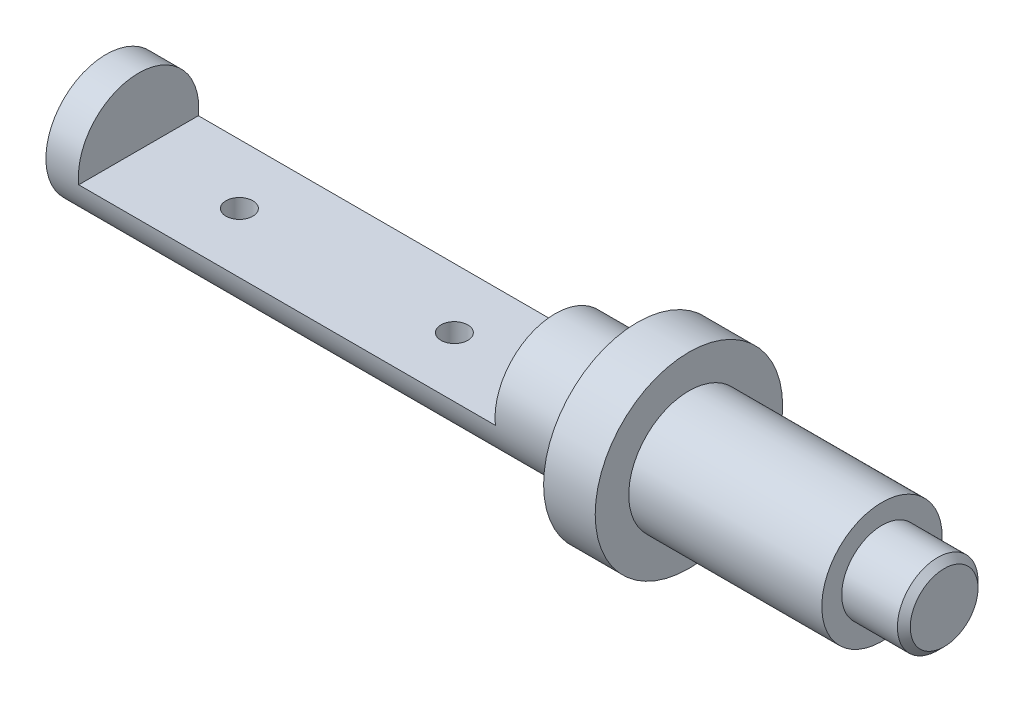
ISO-10303-21;
HEADER;
FILE_DESCRIPTION(('STEP AP214'),'2;1');
FILE_NAME('part.step','',(''),(''),'','','');
FILE_SCHEMA(('AUTOMOTIVE_DESIGN { 1 0 10303 214 1 1 1 1 }'));
ENDSEC;
DATA;
#1=APPLICATION_CONTEXT('core data for automotive mechanical design processes');
#2=APPLICATION_PROTOCOL_DEFINITION('international standard','automotive_design',2000,#1);
#3=PRODUCT_CONTEXT('',#1,'mechanical');
#4=PRODUCT('Part','Part','',(#3));
#5=PRODUCT_RELATED_PRODUCT_CATEGORY('part','',(#4));
#6=PRODUCT_DEFINITION_FORMATION('','',#4);
#7=PRODUCT_DEFINITION_CONTEXT('part definition',#1,'design');
#8=PRODUCT_DEFINITION('design','',#6,#7);
#9=PRODUCT_DEFINITION_SHAPE('','',#8);
#10=(LENGTH_UNIT() NAMED_UNIT(*) SI_UNIT(.MILLI.,.METRE.));
#11=(NAMED_UNIT(*) PLANE_ANGLE_UNIT() SI_UNIT($,.RADIAN.));
#12=(NAMED_UNIT(*) SI_UNIT($,.STERADIAN.) SOLID_ANGLE_UNIT());
#13=UNCERTAINTY_MEASURE_WITH_UNIT(LENGTH_MEASURE(1.E-05),#10,'distance_accuracy_value','');
#14=(GEOMETRIC_REPRESENTATION_CONTEXT(3) GLOBAL_UNCERTAINTY_ASSIGNED_CONTEXT((#13)) GLOBAL_UNIT_ASSIGNED_CONTEXT((#10,
#11,#12)) REPRESENTATION_CONTEXT('',''));
#15=CARTESIAN_POINT('',(0.,0.,0.));
#16=DIRECTION('',(0.,0.,1.));
#17=DIRECTION('',(1.,0.,0.));
#18=AXIS2_PLACEMENT_3D('',#15,#16,#17);
#19=CARTESIAN_POINT('',(247.1,0.,0.));
#20=DIRECTION('',(-1.,0.,0.));
#21=DIRECTION('',(0.,0.,1.));
#22=AXIS2_PLACEMENT_3D('',#19,#20,#21);
#23=CYLINDRICAL_SURFACE('',#22,28.);
#24=CARTESIAN_POINT('',(62.,-27.2935431924842,6.25));
#25=CARTESIAN_POINT('',(61.8267727598686,-27.2935406630598,6.25000418094473));
#26=CARTESIAN_POINT('',(61.6535945838765,-27.2951952944761,6.24279659776609));
#27=CARTESIAN_POINT('',(61.3084452049208,-27.3017584796593,6.21403440350836));
#28=CARTESIAN_POINT('',(61.1364741812,-27.3066675067386,6.19247770552275));
#29=CARTESIAN_POINT('',(60.7949630146807,-27.3195986301189,6.1351760833499));
#30=CARTESIAN_POINT('',(60.6254239581023,-27.3276220751525,6.09942501198105));
#31=CARTESIAN_POINT('',(60.2899852832194,-27.3465464155529,6.0140096724512));
#32=CARTESIAN_POINT('',(60.1240870317926,-27.3574483722473,5.96434027208897));
#33=CARTESIAN_POINT('',(59.7973982391902,-27.3817905916842,5.8515692430011));
#34=CARTESIAN_POINT('',(59.6366003461767,-27.3952269869804,5.78848806167798));
#35=CARTESIAN_POINT('',(59.3208790393078,-27.4242678496656,5.64929956777815));
#36=CARTESIAN_POINT('',(59.1659578199311,-27.4398731170088,5.57318744653334));
#37=CARTESIAN_POINT('',(58.8631396758863,-27.4728000717142,5.40853934345901));
#38=CARTESIAN_POINT('',(58.7152399398922,-27.4901210633973,5.32000839111389));
#39=CARTESIAN_POINT('',(58.4273048075419,-27.5260101395214,5.13108281812592));
#40=CARTESIAN_POINT('',(58.2872723861792,-27.5445786899706,5.03068375356068));
#41=CARTESIAN_POINT('',(58.013935535353,-27.5827411710545,4.81708795276356));
#42=CARTESIAN_POINT('',(57.8807683889474,-27.6023465077547,4.70371753740178));
#43=CARTESIAN_POINT('',(57.6243676029388,-27.6417727676251,4.46619442991224));
#44=CARTESIAN_POINT('',(57.5011376659008,-27.6615937680575,4.34203775433223));
#45=CARTESIAN_POINT('',(57.2655232423443,-27.7008894748951,4.08384197537745));
#46=CARTESIAN_POINT('',(57.1531356719486,-27.7203642784753,3.9498057012888));
#47=CARTESIAN_POINT('',(56.9398937419835,-27.7584430824459,3.67265674935636));
#48=CARTESIAN_POINT('',(56.8390436467614,-27.7770467593696,3.5295407457563));
#49=CARTESIAN_POINT('',(56.6486245646214,-27.813052346094,3.23365995739578));
#50=CARTESIAN_POINT('',(56.559186955487,-27.8304393713552,3.08080874634002));
#51=CARTESIAN_POINT('',(56.3934979284126,-27.8633050823482,2.76785167600483));
#52=CARTESIAN_POINT('',(56.3172514737377,-27.8787830491573,2.60774311456664));
#53=CARTESIAN_POINT('',(56.1786061723866,-27.9073737582624,2.28150107379451));
#54=CARTESIAN_POINT('',(56.1162009342469,-27.9204875917193,2.11537041669151));
#55=CARTESIAN_POINT('',(56.0056756050297,-27.9439896454641,1.7782375642397));
#56=CARTESIAN_POINT('',(55.957560676261,-27.9543768806238,1.60723363283174));
#57=CARTESIAN_POINT('',(55.8366940053748,-27.9806601200355,1.09439758323674));
#58=CARTESIAN_POINT('',(55.7849884834218,-27.9921960538677,0.746994222027666));
#59=CARTESIAN_POINT('',(55.7515346610221,-27.9996585490209,0.223520525139074));
#60=CARTESIAN_POINT('',(55.7477414297263,-28.0005041840467,0.0485642360945816));
#61=CARTESIAN_POINT('',(55.7548089715722,-27.9989265851302,-0.301058844425902));
#62=CARTESIAN_POINT('',(55.7656699488484,-27.9965033056516,-0.475725631835172));
#63=CARTESIAN_POINT('',(55.819554977227,-27.9845298925051,-0.991080970449512));
#64=CARTESIAN_POINT('',(55.8834769760275,-27.9703645197021,-1.32971272514979));
#65=CARTESIAN_POINT('',(56.0657163769346,-27.9310839487509,-1.99113945055511));
#66=CARTESIAN_POINT('',(56.1840363043649,-27.9059682422566,-2.31393368526248));
#67=CARTESIAN_POINT('',(56.4726136935572,-27.8472521946706,-2.9375819596219));
#68=CARTESIAN_POINT('',(56.6432572483036,-27.8135891116371,-3.23825157149134));
#69=CARTESIAN_POINT('',(57.0313486445811,-27.7414625355304,-3.80704732566786));
#70=CARTESIAN_POINT('',(57.2488031079672,-27.7029983636206,-4.07516885533364));
#71=CARTESIAN_POINT('',(57.729924683463,-27.6245113562129,-4.57738580559884));
#72=CARTESIAN_POINT('',(57.9944906861916,-27.5844728055815,-4.81061849864798));
#73=CARTESIAN_POINT('',(58.5593957192654,-27.5081274935844,-5.22957036099764));
#74=CARTESIAN_POINT('',(58.8597358020281,-27.4718208420638,-5.41528813197723));
#75=CARTESIAN_POINT('',(59.4890983296703,-27.4070063654906,-5.73434528879876));
#76=CARTESIAN_POINT('',(59.818209250125,-27.3785237986948,-5.86751562740584));
#77=CARTESIAN_POINT('',(60.4949262723236,-27.332928106913,-6.07639622505651));
#78=CARTESIAN_POINT('',(60.8425292948424,-27.3158130954113,-6.15211601866805));
#79=CARTESIAN_POINT('',(61.5384634697485,-27.2952766976967,-6.24259542089443));
#80=CARTESIAN_POINT('',(61.8866227947728,-27.291572561069,-6.25861396727172));
#81=CARTESIAN_POINT('',(62.5806372664177,-27.2975136372093,-6.23264970129104));
#82=CARTESIAN_POINT('',(62.9264925766479,-27.3071578917233,-6.19067105243459));
#83=CARTESIAN_POINT('',(63.6016587871162,-27.3384415167487,-6.0509982957265));
#84=CARTESIAN_POINT('',(63.9311218532032,-27.3599303668854,-5.95400289682963));
#85=CARTESIAN_POINT('',(64.569119561196,-27.4123452195024,-5.70780773520873));
#86=CARTESIAN_POINT('',(64.8776521284731,-27.443272155819,-5.55860280648198));
#87=CARTESIAN_POINT('',(65.4704621534331,-27.5116960387507,-5.20947386615223));
#88=CARTESIAN_POINT('',(65.7542732390405,-27.5492900747217,-5.00877748022629));
#89=CARTESIAN_POINT('',(66.2846538000829,-27.6265592430673,-4.56335143969624));
#90=CARTESIAN_POINT('',(66.5312184416144,-27.6662346446662,-4.3186160786589));
#91=CARTESIAN_POINT('',(66.98500466893,-27.7441297258463,-3.78641602648042));
#92=CARTESIAN_POINT('',(67.1913659211403,-27.7823059698253,-3.49821158905154));
#93=CARTESIAN_POINT('',(67.5527917615435,-27.8520981732882,-2.89029963896411));
#94=CARTESIAN_POINT('',(67.7078587965041,-27.8837144456601,-2.57059362989544));
#95=CARTESIAN_POINT('',(67.8978877198154,-27.9234467514472,-2.07570333708499));
#96=CARTESIAN_POINT('',(67.9540381691156,-27.9353862929346,-1.90866854996694));
#97=CARTESIAN_POINT('',(68.0520741970871,-27.9564443638961,-1.57030628341015));
#98=CARTESIAN_POINT('',(68.0939650692829,-27.9655639400989,-1.39898042234159));
#99=CARTESIAN_POINT('',(68.1631339402457,-27.9807181181667,-1.05326831573389));
#100=CARTESIAN_POINT('',(68.190410923789,-27.986752505703,-0.878881858444701));
#101=CARTESIAN_POINT('',(68.2301247347132,-27.9955635060914,-0.528347318502349));
#102=CARTESIAN_POINT('',(68.2425621553816,-27.9983402491844,-0.352199306560297));
#103=CARTESIAN_POINT('',(68.2523827048559,-28.0005315872801,-0.00328258899923557));
#104=CARTESIAN_POINT('',(68.250085760547,-28.0000176335599,0.169476763448765));
#105=CARTESIAN_POINT('',(68.2312052525231,-27.9958092230281,0.514171279855283));
#106=CARTESIAN_POINT('',(68.2146219799416,-27.992114831029,0.686106460537359));
#107=CARTESIAN_POINT('',(68.1673008891383,-27.9816470037885,1.02794898351237));
#108=CARTESIAN_POINT('',(68.1365608405084,-27.9748730833678,1.19785600193811));
#109=CARTESIAN_POINT('',(68.0611864987827,-27.9584357777394,1.53435186906267));
#110=CARTESIAN_POINT('',(68.0165571474954,-27.9487734202847,1.70094187555779));
#111=CARTESIAN_POINT('',(67.9139133361203,-27.9268574568712,2.02918872938452));
#112=CARTESIAN_POINT('',(67.8559415493875,-27.9146121223051,2.19085948233516));
#113=CARTESIAN_POINT('',(67.7269966145685,-27.8878471112107,2.50866639727836));
#114=CARTESIAN_POINT('',(67.6560280366416,-27.8733282344044,2.66480448180284));
#115=CARTESIAN_POINT('',(67.501559769507,-27.8423945526458,2.97063998638388));
#116=CARTESIAN_POINT('',(67.4180547531253,-27.825978942391,3.12033463343339));
#117=CARTESIAN_POINT('',(67.2391533318032,-27.7916988602938,3.41219288944291));
#118=CARTESIAN_POINT('',(67.1437609417994,-27.7738348783443,3.55435901815255));
#119=CARTESIAN_POINT('',(66.9396806765526,-27.7367568229686,3.83307740152881));
#120=CARTESIAN_POINT('',(66.8307645819695,-27.7175228620528,3.96945995543579));
#121=CARTESIAN_POINT('',(66.6019929027212,-27.67856827949,4.23255724998559));
#122=CARTESIAN_POINT('',(66.4821411207662,-27.6588478287394,4.35927532336927));
#123=CARTESIAN_POINT('',(66.2321906977458,-27.619444285287,4.60233284521469));
#124=CARTESIAN_POINT('',(66.1020859558028,-27.5997612220746,4.71866602514744));
#125=CARTESIAN_POINT('',(65.8326020185938,-27.5609972321728,4.94004645388396));
#126=CARTESIAN_POINT('',(65.6932262291355,-27.5419160881188,5.04509781049821));
#127=CARTESIAN_POINT('',(65.4039951713818,-27.5046146614129,5.24467646780603));
#128=CARTESIAN_POINT('',(65.2540174677039,-27.4864108262583,5.33902953184629));
#129=CARTESIAN_POINT('',(64.9465022207077,-27.4517038520395,5.51470510633685));
#130=CARTESIAN_POINT('',(64.7889674894038,-27.4352000874545,5.59603241561453));
#131=CARTESIAN_POINT('',(64.4674592811525,-27.4043843599854,5.74504238460735));
#132=CARTESIAN_POINT('',(64.3034893195969,-27.3900712207976,5.81273237339837));
#133=CARTESIAN_POINT('',(63.97025885759,-27.3640603447371,5.93397254806088));
#134=CARTESIAN_POINT('',(63.8009992932005,-27.3523621480712,5.98752522003901));
#135=CARTESIAN_POINT('',(63.3647112632614,-27.3263643748797,6.10534932009698));
#136=CARTESIAN_POINT('',(63.0947562756293,-27.3141314337926,6.15951030297508));
#137=CARTESIAN_POINT('',(62.5498261754481,-27.2977230622745,6.2318313742948));
#138=CARTESIAN_POINT('',(62.2748513291159,-27.2935472058002,6.24999336629612));
#139=CARTESIAN_POINT('',(62.,-27.2935431924842,6.25));
#140=B_SPLINE_CURVE_WITH_KNOTS('',3,(#24,#25,#26,#27,#28,#29,#30,#31,#32,#33,#34,#35,#36,#37,
#38,#39,#40,#41,#42,#43,#44,#45,#46,#47,#48,#49,#50,#51,#52,#53,#54,#55,#56,#57,#58,#59,#60,#61,
#62,#63,#64,#65,#66,#67,#68,#69,#70,#71,#72,#73,#74,#75,#76,#77,#78,#79,#80,#81,#82,#83,#84,#85,
#86,#87,#88,#89,#90,#91,#92,#93,#94,#95,#96,#97,#98,#99,#100,#101,#102,#103,#104,#105,#106,#107,
#108,#109,#110,#111,#112,#113,#114,#115,#116,#117,#118,#119,#120,#121,#122,#123,#124,#125,#126,
#127,#128,#129,#130,#131,#132,#133,#134,#135,#136,#137,#138,#139),.UNSPECIFIED.,.T.,.F.,(4,2,2,
2,2,2,2,2,2,2,2,2,2,2,2,2,2,2,2,2,2,2,2,2,2,2,2,2,2,2,2,2,2,2,2,2,2,2,2,2,2,2,2,2,2,2,2,2,2,2,2,
2,2,2,2,2,2,4),(0.,0.519439608500139,1.03895477976752,1.55869518419967,2.07862748884639,
2.59777272482058,3.1171099499522,3.63623745343966,4.15555995961572,4.68290174643606,
5.21043911948484,5.73782600077029,6.26540718315176,6.79859906273959,7.33199112529032,
7.86513636801499,8.39847397341278,9.44659898859372,9.97108019976341,10.4955687170816,
11.5250017072293,12.5544824917318,13.5917504134608,14.6291651632887,15.6890487552906,
16.7489635351156,17.8122608342571,18.8753816285583,19.9159529707268,20.9564496162611,
21.9840187566687,23.0116896012437,24.0557822772237,25.10001034103,26.1645877935077,
27.229114457624,27.7584522517355,28.2875933270914,28.8167711569939,29.3459278295956,
29.8636344148691,30.3813304503266,30.8991080770091,31.4167016888243,31.9326623270648,
32.4484418813475,32.9644412321529,33.4802667751747,34.0064342303606,34.5324194115064,
35.0587199707588,35.5848282449849,36.1185476697549,36.6520700120354,37.1853048551527,
37.7184458641198,38.542659288208,39.3668291282597),.UNSPECIFIED.);
#141=CARTESIAN_POINT('',(62.,-27.2935431924842,6.25));
#142=VERTEX_POINT('',#141);
#143=EDGE_CURVE('E76',#142,#142,#140,.T.);
#144=ORIENTED_EDGE('',*,*,#143,.F.);
#145=EDGE_LOOP('',(#144));
#146=FACE_BOUND('',#145,.T.);
#147=CARTESIAN_POINT('',(162.,-27.2935431924842,6.25));
#148=CARTESIAN_POINT('',(161.826772759869,-27.2935406630598,6.25000418094473));
#149=CARTESIAN_POINT('',(161.653594583877,-27.2951952944761,6.24279659776609));
#150=CARTESIAN_POINT('',(161.308445204921,-27.3017584796593,6.21403440350836));
#151=CARTESIAN_POINT('',(161.1364741812,-27.3066675067386,6.19247770552275));
#152=CARTESIAN_POINT('',(160.794963014681,-27.3195986301189,6.1351760833499));
#153=CARTESIAN_POINT('',(160.625423958102,-27.3276220751525,6.09942501198105));
#154=CARTESIAN_POINT('',(160.289985283219,-27.3465464155529,6.0140096724512));
#155=CARTESIAN_POINT('',(160.124087031793,-27.3574483722473,5.96434027208896));
#156=CARTESIAN_POINT('',(159.79739823919,-27.3817905916842,5.85156924300109));
#157=CARTESIAN_POINT('',(159.636600346177,-27.3952269869804,5.78848806167797));
#158=CARTESIAN_POINT('',(159.320879039308,-27.4242678496656,5.64929956777814));
#159=CARTESIAN_POINT('',(159.165957819931,-27.4398731170088,5.57318744653333));
#160=CARTESIAN_POINT('',(158.863139675886,-27.4728000717142,5.40853934345899));
#161=CARTESIAN_POINT('',(158.715239939892,-27.4901210633973,5.32000839111387));
#162=CARTESIAN_POINT('',(158.427304807542,-27.5260101395214,5.1310828181259));
#163=CARTESIAN_POINT('',(158.287272386179,-27.5445786899706,5.03068375356067));
#164=CARTESIAN_POINT('',(158.013935535353,-27.5827411710545,4.81708795276356));
#165=CARTESIAN_POINT('',(157.880768388947,-27.6023465077547,4.70371753740177));
#166=CARTESIAN_POINT('',(157.624367602939,-27.6417727676251,4.46619442991223));
#167=CARTESIAN_POINT('',(157.501137665901,-27.6615937680575,4.34203775433222));
#168=CARTESIAN_POINT('',(157.265523242344,-27.7008894748951,4.08384197537743));
#169=CARTESIAN_POINT('',(157.153135671949,-27.7203642784753,3.94980570128878));
#170=CARTESIAN_POINT('',(156.939893741983,-27.7584430824459,3.67265674935633));
#171=CARTESIAN_POINT('',(156.839043646761,-27.7770467593696,3.52954074575627));
#172=CARTESIAN_POINT('',(156.648624564621,-27.813052346094,3.23365995739575));
#173=CARTESIAN_POINT('',(156.559186955487,-27.8304393713552,3.08080874633999));
#174=CARTESIAN_POINT('',(156.393497928413,-27.8633050823483,2.7678516760048));
#175=CARTESIAN_POINT('',(156.317251473738,-27.8787830491573,2.60774311456661));
#176=CARTESIAN_POINT('',(156.178606172387,-27.9073737582624,2.28150107379449));
#177=CARTESIAN_POINT('',(156.116200934247,-27.9204875917193,2.11537041669149));
#178=CARTESIAN_POINT('',(156.00567560503,-27.9439896454641,1.77823756423969));
#179=CARTESIAN_POINT('',(155.957560676261,-27.9543768806238,1.60723363283173));
#180=CARTESIAN_POINT('',(155.836694005375,-27.9806601200355,1.09439758323673));
#181=CARTESIAN_POINT('',(155.784988483422,-27.9921960538677,0.746994222027654));
#182=CARTESIAN_POINT('',(155.751534661022,-27.9996585490209,0.22352052513906));
#183=CARTESIAN_POINT('',(155.747741429726,-28.0005041840467,0.0485642360945672));
#184=CARTESIAN_POINT('',(155.754808971572,-27.9989265851302,-0.301058844425917));
#185=CARTESIAN_POINT('',(155.765669948848,-27.9965033056516,-0.475725631835187));
#186=CARTESIAN_POINT('',(155.819554977227,-27.9845298925051,-0.99108097044953));
#187=CARTESIAN_POINT('',(155.883476976027,-27.9703645197021,-1.32971272514981));
#188=CARTESIAN_POINT('',(156.065716376935,-27.9310839487509,-1.99113945055513));
#189=CARTESIAN_POINT('',(156.184036304365,-27.9059682422566,-2.31393368526249));
#190=CARTESIAN_POINT('',(156.472613693557,-27.8472521946706,-2.93758195962191));
#191=CARTESIAN_POINT('',(156.643257248304,-27.8135891116371,-3.23825157149135));
#192=CARTESIAN_POINT('',(157.031348644581,-27.7414625355304,-3.80704732566788));
#193=CARTESIAN_POINT('',(157.248803107967,-27.7029983636206,-4.07516885533365));
#194=CARTESIAN_POINT('',(157.729924683463,-27.6245113562129,-4.57738580559885));
#195=CARTESIAN_POINT('',(157.994490686192,-27.5844728055815,-4.81061849864799));
#196=CARTESIAN_POINT('',(158.559395719265,-27.5081274935844,-5.22957036099765));
#197=CARTESIAN_POINT('',(158.859735802028,-27.4718208420638,-5.41528813197724));
#198=CARTESIAN_POINT('',(159.48909832967,-27.4070063654906,-5.73434528879876));
#199=CARTESIAN_POINT('',(159.818209250125,-27.3785237986948,-5.86751562740585));
#200=CARTESIAN_POINT('',(160.494926272324,-27.332928106913,-6.07639622505651));
#201=CARTESIAN_POINT('',(160.842529294842,-27.3158130954113,-6.15211601866805));
#202=CARTESIAN_POINT('',(161.538463469748,-27.2952766976967,-6.24259542089443));
#203=CARTESIAN_POINT('',(161.886622794773,-27.291572561069,-6.25861396727172));
#204=CARTESIAN_POINT('',(162.580637266418,-27.2975136372093,-6.23264970129104));
#205=CARTESIAN_POINT('',(162.926492576648,-27.3071578917233,-6.19067105243459));
#206=CARTESIAN_POINT('',(163.601658787116,-27.3384415167487,-6.0509982957265));
#207=CARTESIAN_POINT('',(163.931121853203,-27.3599303668854,-5.95400289682962));
#208=CARTESIAN_POINT('',(164.569119561196,-27.4123452195024,-5.70780773520872));
#209=CARTESIAN_POINT('',(164.877652128473,-27.443272155819,-5.55860280648197));
#210=CARTESIAN_POINT('',(165.470462153433,-27.5116960387507,-5.20947386615222));
#211=CARTESIAN_POINT('',(165.754273239041,-27.5492900747217,-5.00877748022627));
#212=CARTESIAN_POINT('',(166.284653800083,-27.6265592430673,-4.56335143969623));
#213=CARTESIAN_POINT('',(166.531218441614,-27.6662346446662,-4.31861607865889));
#214=CARTESIAN_POINT('',(166.98500466893,-27.7441297258463,-3.78641602648041));
#215=CARTESIAN_POINT('',(167.19136592114,-27.7823059698253,-3.49821158905152));
#216=CARTESIAN_POINT('',(167.552791761544,-27.8520981732882,-2.89029963896408));
#217=CARTESIAN_POINT('',(167.707858796504,-27.8837144456601,-2.57059362989542));
#218=CARTESIAN_POINT('',(167.897887719815,-27.9234467514472,-2.07570333708496));
#219=CARTESIAN_POINT('',(167.954038169116,-27.9353862929347,-1.9086685499669));
#220=CARTESIAN_POINT('',(168.052074197087,-27.9564443638961,-1.57030628341012));
#221=CARTESIAN_POINT('',(168.093965069283,-27.9655639400989,-1.39898042234157));
#222=CARTESIAN_POINT('',(168.163133940246,-27.9807181181667,-1.05326831573387));
#223=CARTESIAN_POINT('',(168.190410923789,-27.986752505703,-0.878881858444676));
#224=CARTESIAN_POINT('',(168.230124734713,-27.9955635060914,-0.528347318502326));
#225=CARTESIAN_POINT('',(168.242562155382,-27.9983402491844,-0.352199306560276));
#226=CARTESIAN_POINT('',(168.252382704856,-28.0005315872801,-0.00328258899921573));
#227=CARTESIAN_POINT('',(168.250085760547,-28.0000176335599,0.169476763448785));
#228=CARTESIAN_POINT('',(168.231205252523,-27.9958092230281,0.514171279855303));
#229=CARTESIAN_POINT('',(168.214621979942,-27.992114831029,0.68610646053738));
#230=CARTESIAN_POINT('',(168.167300889138,-27.9816470037885,1.02794898351239));
#231=CARTESIAN_POINT('',(168.136560840508,-27.9748730833678,1.19785600193814));
#232=CARTESIAN_POINT('',(168.061186498783,-27.9584357777394,1.53435186906269));
#233=CARTESIAN_POINT('',(168.016557147495,-27.9487734202847,1.70094187555781));
#234=CARTESIAN_POINT('',(167.91391333612,-27.9268574568712,2.02918872938454));
#235=CARTESIAN_POINT('',(167.855941549387,-27.9146121223051,2.19085948233518));
#236=CARTESIAN_POINT('',(167.726996614568,-27.8878471112107,2.50866639727837));
#237=CARTESIAN_POINT('',(167.656028036642,-27.8733282344044,2.66480448180285));
#238=CARTESIAN_POINT('',(167.501559769507,-27.8423945526458,2.97063998638388));
#239=CARTESIAN_POINT('',(167.418054753125,-27.825978942391,3.12033463343339));
#240=CARTESIAN_POINT('',(167.239153331803,-27.7916988602938,3.41219288944291));
#241=CARTESIAN_POINT('',(167.143760941799,-27.7738348783443,3.55435901815255));
#242=CARTESIAN_POINT('',(166.939680676553,-27.7367568229686,3.83307740152883));
#243=CARTESIAN_POINT('',(166.83076458197,-27.7175228620528,3.9694599554358));
#244=CARTESIAN_POINT('',(166.601992902721,-27.67856827949,4.23255724998561));
#245=CARTESIAN_POINT('',(166.482141120766,-27.6588478287394,4.35927532336928));
#246=CARTESIAN_POINT('',(166.232190697746,-27.619444285287,4.6023328452147));
#247=CARTESIAN_POINT('',(166.102085955803,-27.5997612220746,4.71866602514746));
#248=CARTESIAN_POINT('',(165.832602018594,-27.5609972321728,4.94004645388397));
#249=CARTESIAN_POINT('',(165.693226229135,-27.5419160881187,5.04509781049822));
#250=CARTESIAN_POINT('',(165.403995171382,-27.5046146614129,5.24467646780604));
#251=CARTESIAN_POINT('',(165.254017467704,-27.4864108262583,5.33902953184629));
#252=CARTESIAN_POINT('',(164.946502220708,-27.4517038520395,5.51470510633686));
#253=CARTESIAN_POINT('',(164.788967489404,-27.4352000874545,5.59603241561454));
#254=CARTESIAN_POINT('',(164.467459281153,-27.4043843599854,5.74504238460736));
#255=CARTESIAN_POINT('',(164.303489319597,-27.3900712207976,5.81273237339838));
#256=CARTESIAN_POINT('',(163.97025885759,-27.3640603447371,5.93397254806089));
#257=CARTESIAN_POINT('',(163.8009992932,-27.3523621480712,5.98752522003902));
#258=CARTESIAN_POINT('',(163.364711263261,-27.3263643748797,6.10534932009699));
#259=CARTESIAN_POINT('',(163.094756275629,-27.3141314337926,6.15951030297509));
#260=CARTESIAN_POINT('',(162.549826175448,-27.2977230622745,6.2318313742948));
#261=CARTESIAN_POINT('',(162.274851329116,-27.2935472058002,6.24999336629612));
#262=CARTESIAN_POINT('',(162.,-27.2935431924842,6.25));
#263=B_SPLINE_CURVE_WITH_KNOTS('',3,(#147,#148,#149,#150,#151,#152,#153,#154,#155,#156,#157,
#158,#159,#160,#161,#162,#163,#164,#165,#166,#167,#168,#169,#170,#171,#172,#173,#174,#175,#176,
#177,#178,#179,#180,#181,#182,#183,#184,#185,#186,#187,#188,#189,#190,#191,#192,#193,#194,#195,
#196,#197,#198,#199,#200,#201,#202,#203,#204,#205,#206,#207,#208,#209,#210,#211,#212,#213,#214,
#215,#216,#217,#218,#219,#220,#221,#222,#223,#224,#225,#226,#227,#228,#229,#230,#231,#232,#233,
#234,#235,#236,#237,#238,#239,#240,#241,#242,#243,#244,#245,#246,#247,#248,#249,#250,#251,#252,
#253,#254,#255,#256,#257,#258,#259,#260,#261,#262),.UNSPECIFIED.,.T.,.F.,(4,2,2,2,2,2,2,2,2,2,2,
2,2,2,2,2,2,2,2,2,2,2,2,2,2,2,2,2,2,2,2,2,2,2,2,2,2,2,2,2,2,2,2,2,2,2,2,2,2,2,2,2,2,2,2,2,2,4),
(0.,0.519439608500166,1.03895477976753,1.5586951841997,2.07862748884639,2.5977727248206,
3.11710994995223,3.63623745343969,4.15555995961573,4.68290174643605,5.21043911948487,
5.73782600077033,6.26540718315181,6.79859906273962,7.33199112529035,7.865136368015,
8.39847397341279,9.44659898859374,9.97108019976342,10.4955687170816,11.5250017072293,
12.5544824917318,13.5917504134609,14.6291651632887,15.6890487552906,16.7489635351156,
17.8122608342571,18.8753816285583,19.9159529707268,20.9564496162611,21.9840187566687,
23.0116896012437,24.0557822772237,25.10001034103,26.1645877935077,27.229114457624,
27.7584522517356,28.2875933270914,28.8167711569939,29.3459278295956,29.8636344148691,
30.3813304503266,30.8991080770091,31.4167016888243,31.9326623270648,32.4484418813475,
32.9644412321529,33.4802667751747,34.0064342303606,34.5324194115064,35.0587199707589,
35.5848282449849,36.1185476697549,36.6520700120354,37.1853048551527,37.7184458641198,
38.542659288208,39.3668291282597),.UNSPECIFIED.);
#264=CARTESIAN_POINT('',(162.,-27.2935431924842,6.25));
#265=VERTEX_POINT('',#264);
#266=EDGE_CURVE('E112',#265,#265,#263,.T.);
#267=ORIENTED_EDGE('',*,*,#266,.F.);
#268=EDGE_LOOP('',(#267));
#269=FACE_BOUND('',#268,.T.);
#270=DIRECTION('',(-1.,0.,0.));
#271=VECTOR('',#270,1.);
#272=CARTESIAN_POINT('',(247.1,-3.1,27.8278637340346));
#273=LINE('',#272,#271);
#274=CARTESIAN_POINT('',(208.9,-3.1,27.8278637340346));
#275=VERTEX_POINT('',#274);
#276=CARTESIAN_POINT('',(15.1,-3.1,27.8278637340346));
#277=VERTEX_POINT('',#276);
#278=EDGE_CURVE('E11',#275,#277,#273,.T.);
#279=ORIENTED_EDGE('',*,*,#278,.T.);
#280=CARTESIAN_POINT('',(15.1,0.,0.));
#281=DIRECTION('',(-1.,0.,0.));
#282=DIRECTION('',(0.,0.,1.));
#283=AXIS2_PLACEMENT_3D('',#280,#281,#282);
#284=CIRCLE('',#283,28.);
#285=CARTESIAN_POINT('',(15.1,-3.1,-27.8278637340346));
#286=VERTEX_POINT('',#285);
#287=EDGE_CURVE('E48',#277,#286,#284,.T.);
#288=ORIENTED_EDGE('',*,*,#287,.T.);
#289=DIRECTION('',(-1.,0.,0.));
#290=VECTOR('',#289,1.);
#291=CARTESIAN_POINT('',(247.1,-3.1,-27.8278637340346));
#292=LINE('',#291,#290);
#293=CARTESIAN_POINT('',(208.9,-3.1,-27.8278637340346));
#294=VERTEX_POINT('',#293);
#295=EDGE_CURVE('E67',#286,#294,#292,.F.);
#296=ORIENTED_EDGE('',*,*,#295,.T.);
#297=CARTESIAN_POINT('',(208.9,0.,0.));
#298=DIRECTION('',(1.,0.,0.));
#299=DIRECTION('',(0.,0.,-1.));
#300=AXIS2_PLACEMENT_3D('',#297,#298,#299);
#301=CIRCLE('',#300,28.);
#302=EDGE_CURVE('E61',#294,#275,#301,.T.);
#303=ORIENTED_EDGE('',*,*,#302,.T.);
#304=EDGE_LOOP('',(#279,#288,#296,#303));
#305=FACE_BOUND('',#304,.T.);
#306=CARTESIAN_POINT('',(247.1,0.,0.));
#307=DIRECTION('',(1.,0.,0.));
#308=DIRECTION('',(0.,0.,-1.));
#309=AXIS2_PLACEMENT_3D('',#306,#307,#308);
#310=CIRCLE('',#309,28.);
#311=CARTESIAN_POINT('',(247.1,0.,-28.));
#312=VERTEX_POINT('',#311);
#313=EDGE_CURVE('E90',#312,#312,#310,.T.);
#314=ORIENTED_EDGE('',*,*,#313,.F.);
#315=EDGE_LOOP('',(#314));
#316=FACE_BOUND('',#315,.T.);
#317=CARTESIAN_POINT('',(0.,0.,0.));
#318=DIRECTION('',(1.,0.,0.));
#319=DIRECTION('',(0.,0.,-1.));
#320=AXIS2_PLACEMENT_3D('',#317,#318,#319);
#321=CIRCLE('',#320,28.);
#322=CARTESIAN_POINT('',(0.,0.,-28.));
#323=VERTEX_POINT('',#322);
#324=EDGE_CURVE('E87',#323,#323,#321,.T.);
#325=ORIENTED_EDGE('',*,*,#324,.T.);
#326=EDGE_LOOP('',(#325));
#327=FACE_BOUND('',#326,.T.);
#328=ADVANCED_FACE('F39',(#146,#269,#305,#316,#327),#23,.T.);
#329=CARTESIAN_POINT('',(0.,0.,0.));
#330=DIRECTION('',(1.,0.,0.));
#331=DIRECTION('',(0.,0.,-1.));
#332=AXIS2_PLACEMENT_3D('',#329,#330,#331);
#333=PLANE('',#332);
#334=ORIENTED_EDGE('',*,*,#324,.F.);
#335=EDGE_LOOP('',(#334));
#336=FACE_BOUND('',#335,.T.);
#337=ADVANCED_FACE('F166',(#336),#333,.F.);
#338=CARTESIAN_POINT('',(271.1,0.,0.));
#339=DIRECTION('',(-1.,0.,0.));
#340=DIRECTION('',(0.,0.,1.));
#341=AXIS2_PLACEMENT_3D('',#338,#339,#340);
#342=CYLINDRICAL_SURFACE('',#341,43.6);
#343=CARTESIAN_POINT('',(271.1,0.,0.));
#344=DIRECTION('',(1.,0.,0.));
#345=DIRECTION('',(0.,0.,-1.));
#346=AXIS2_PLACEMENT_3D('',#343,#344,#345);
#347=CIRCLE('',#346,43.6);
#348=CARTESIAN_POINT('',(271.1,0.,-43.6));
#349=VERTEX_POINT('',#348);
#350=EDGE_CURVE('E91',#349,#349,#347,.T.);
#351=ORIENTED_EDGE('',*,*,#350,.F.);
#352=EDGE_LOOP('',(#351));
#353=FACE_BOUND('',#352,.T.);
#354=CARTESIAN_POINT('',(247.1,0.,0.));
#355=DIRECTION('',(1.,0.,0.));
#356=DIRECTION('',(0.,0.,-1.));
#357=AXIS2_PLACEMENT_3D('',#354,#355,#356);
#358=CIRCLE('',#357,43.6);
#359=CARTESIAN_POINT('',(247.1,0.,-43.6));
#360=VERTEX_POINT('',#359);
#361=EDGE_CURVE('E95',#360,#360,#358,.T.);
#362=ORIENTED_EDGE('',*,*,#361,.T.);
#363=EDGE_LOOP('',(#362));
#364=FACE_BOUND('',#363,.T.);
#365=ADVANCED_FACE('F159',(#353,#364),#342,.T.);
#366=CARTESIAN_POINT('',(271.1,0.,0.));
#367=DIRECTION('',(1.,0.,0.));
#368=DIRECTION('',(0.,0.,-1.));
#369=AXIS2_PLACEMENT_3D('',#366,#367,#368);
#370=PLANE('',#369);
#371=CARTESIAN_POINT('',(271.1,0.,0.));
#372=DIRECTION('',(1.,0.,0.));
#373=DIRECTION('',(0.,0.,-1.));
#374=AXIS2_PLACEMENT_3D('',#371,#372,#373);
#375=CIRCLE('',#374,28.);
#376=CARTESIAN_POINT('',(271.1,0.,-28.));
#377=VERTEX_POINT('',#376);
#378=EDGE_CURVE('E94',#377,#377,#375,.T.);
#379=ORIENTED_EDGE('',*,*,#378,.F.);
#380=EDGE_LOOP('',(#379));
#381=FACE_BOUND('',#380,.T.);
#382=ORIENTED_EDGE('',*,*,#350,.T.);
#383=EDGE_LOOP('',(#382));
#384=FACE_BOUND('',#383,.T.);
#385=ADVANCED_FACE('F156',(#381,#384),#370,.T.);
#386=CARTESIAN_POINT('',(247.1,0.,0.));
#387=DIRECTION('',(1.,0.,0.));
#388=DIRECTION('',(0.,0.,-1.));
#389=AXIS2_PLACEMENT_3D('',#386,#387,#388);
#390=PLANE('',#389);
#391=ORIENTED_EDGE('',*,*,#313,.T.);
#392=EDGE_LOOP('',(#391));
#393=FACE_BOUND('',#392,.T.);
#394=ORIENTED_EDGE('',*,*,#361,.F.);
#395=EDGE_LOOP('',(#394));
#396=FACE_BOUND('',#395,.T.);
#397=ADVANCED_FACE('F154',(#393,#396),#390,.F.);
#398=CARTESIAN_POINT('',(360.9,0.,0.));
#399=DIRECTION('',(-1.,0.,0.));
#400=DIRECTION('',(0.,0.,1.));
#401=AXIS2_PLACEMENT_3D('',#398,#399,#400);
#402=CYLINDRICAL_SURFACE('',#401,28.);
#403=CARTESIAN_POINT('',(360.9,0.,0.));
#404=DIRECTION('',(1.,0.,0.));
#405=DIRECTION('',(0.,0.,-1.));
#406=AXIS2_PLACEMENT_3D('',#403,#404,#405);
#407=CIRCLE('',#406,28.);
#408=CARTESIAN_POINT('',(360.9,0.,-28.));
#409=VERTEX_POINT('',#408);
#410=EDGE_CURVE('E98',#409,#409,#407,.T.);
#411=ORIENTED_EDGE('',*,*,#410,.F.);
#412=EDGE_LOOP('',(#411));
#413=FACE_BOUND('',#412,.T.);
#414=ORIENTED_EDGE('',*,*,#378,.T.);
#415=EDGE_LOOP('',(#414));
#416=FACE_BOUND('',#415,.T.);
#417=ADVANCED_FACE('F150',(#413,#416),#402,.T.);
#418=CARTESIAN_POINT('',(360.9,0.,0.));
#419=DIRECTION('',(1.,0.,0.));
#420=DIRECTION('',(0.,0.,-1.));
#421=AXIS2_PLACEMENT_3D('',#418,#419,#420);
#422=PLANE('',#421);
#423=CARTESIAN_POINT('',(360.9,0.,0.));
#424=DIRECTION('',(1.,0.,0.));
#425=DIRECTION('',(0.,0.,-1.));
#426=AXIS2_PLACEMENT_3D('',#423,#424,#425);
#427=CIRCLE('',#426,18.75);
#428=CARTESIAN_POINT('',(360.9,0.,-18.75));
#429=VERTEX_POINT('',#428);
#430=EDGE_CURVE('E86',#429,#429,#427,.T.);
#431=ORIENTED_EDGE('',*,*,#430,.F.);
#432=EDGE_LOOP('',(#431));
#433=FACE_BOUND('',#432,.T.);
#434=ORIENTED_EDGE('',*,*,#410,.T.);
#435=EDGE_LOOP('',(#434));
#436=FACE_BOUND('',#435,.T.);
#437=ADVANCED_FACE('F146',(#433,#436),#422,.T.);
#438=CARTESIAN_POINT('',(389.8,0.,0.));
#439=DIRECTION('',(-1.,0.,0.));
#440=DIRECTION('',(0.,0.,1.));
#441=AXIS2_PLACEMENT_3D('',#438,#439,#440);
#442=CYLINDRICAL_SURFACE('',#441,18.75);
#443=CARTESIAN_POINT('',(386.8,0.,0.));
#444=DIRECTION('',(1.,0.,0.));
#445=DIRECTION('',(0.,0.,-1.));
#446=AXIS2_PLACEMENT_3D('',#443,#444,#445);
#447=CIRCLE('',#446,18.75);
#448=CARTESIAN_POINT('',(386.8,0.,-18.75));
#449=VERTEX_POINT('',#448);
#450=EDGE_CURVE('E72',#449,#449,#447,.F.);
#451=ORIENTED_EDGE('',*,*,#450,.T.);
#452=EDGE_LOOP('',(#451));
#453=FACE_BOUND('',#452,.T.);
#454=ORIENTED_EDGE('',*,*,#430,.T.);
#455=EDGE_LOOP('',(#454));
#456=FACE_BOUND('',#455,.T.);
#457=ADVANCED_FACE('F142',(#453,#456),#442,.T.);
#458=CARTESIAN_POINT('',(389.8,0.,0.));
#459=DIRECTION('',(1.,0.,0.));
#460=DIRECTION('',(0.,0.,-1.));
#461=AXIS2_PLACEMENT_3D('',#458,#459,#460);
#462=PLANE('',#461);
#463=CARTESIAN_POINT('',(389.8,0.,0.));
#464=DIRECTION('',(1.,0.,0.));
#465=DIRECTION('',(0.,0.,-1.));
#466=AXIS2_PLACEMENT_3D('',#463,#464,#465);
#467=CIRCLE('',#466,15.75);
#468=CARTESIAN_POINT('',(389.8,0.,-15.75));
#469=VERTEX_POINT('',#468);
#470=EDGE_CURVE('E83',#469,#469,#467,.T.);
#471=ORIENTED_EDGE('',*,*,#470,.T.);
#472=EDGE_LOOP('',(#471));
#473=FACE_BOUND('',#472,.T.);
#474=ADVANCED_FACE('F139',(#473),#462,.T.);
#475=CARTESIAN_POINT('',(389.8,0.,0.));
#476=DIRECTION('',(-1.,0.,0.));
#477=DIRECTION('',(0.,0.,1.));
#478=AXIS2_PLACEMENT_3D('',#475,#476,#477);
#479=CONICAL_SURFACE('',#478,15.75,0.785398163397451);
#480=ORIENTED_EDGE('',*,*,#450,.F.);
#481=EDGE_LOOP('',(#480));
#482=FACE_BOUND('',#481,.T.);
#483=ORIENTED_EDGE('',*,*,#470,.F.);
#484=EDGE_LOOP('',(#483));
#485=FACE_BOUND('',#484,.T.);
#486=ADVANCED_FACE('F42',(#482,#485),#479,.T.);
#487=CARTESIAN_POINT('',(15.1,28.,-54.45));
#488=DIRECTION('',(-1.,0.,0.));
#489=DIRECTION('',(0.,0.,1.));
#490=AXIS2_PLACEMENT_3D('',#487,#488,#489);
#491=PLANE('',#490);
#492=ORIENTED_EDGE('',*,*,#287,.F.);
#493=DIRECTION('',(0.,0.,1.));
#494=VECTOR('',#493,1.);
#495=CARTESIAN_POINT('',(15.1,-3.1,-54.45));
#496=LINE('',#495,#494);
#497=EDGE_CURVE('E70',#286,#277,#496,.T.);
#498=ORIENTED_EDGE('',*,*,#497,.F.);
#499=EDGE_LOOP('',(#492,#498));
#500=FACE_BOUND('',#499,.T.);
#501=ADVANCED_FACE('F75',(#500),#491,.F.);
#502=CARTESIAN_POINT('',(208.9,28.,-54.45));
#503=DIRECTION('',(1.,0.,0.));
#504=DIRECTION('',(0.,0.,-1.));
#505=AXIS2_PLACEMENT_3D('',#502,#503,#504);
#506=PLANE('',#505);
#507=ORIENTED_EDGE('',*,*,#302,.F.);
#508=DIRECTION('',(0.,0.,1.));
#509=VECTOR('',#508,1.);
#510=CARTESIAN_POINT('',(208.9,-3.1,-54.45));
#511=LINE('',#510,#509);
#512=EDGE_CURVE('E55',#294,#275,#511,.T.);
#513=ORIENTED_EDGE('',*,*,#512,.T.);
#514=EDGE_LOOP('',(#507,#513));
#515=FACE_BOUND('',#514,.T.);
#516=ADVANCED_FACE('F130',(#515),#506,.F.);
#517=CARTESIAN_POINT('',(15.1,-3.1,-54.45));
#518=DIRECTION('',(0.,-1.,0.));
#519=DIRECTION('',(0.,0.,-1.));
#520=AXIS2_PLACEMENT_3D('',#517,#518,#519);
#521=PLANE('',#520);
#522=CARTESIAN_POINT('',(62.,-3.1,0.));
#523=DIRECTION('',(0.,1.,0.));
#524=DIRECTION('',(0.,0.,1.));
#525=AXIS2_PLACEMENT_3D('',#522,#523,#524);
#526=CIRCLE('',#525,6.25);
#527=CARTESIAN_POINT('',(62.,-3.1,6.25));
#528=VERTEX_POINT('',#527);
#529=EDGE_CURVE('E111',#528,#528,#526,.T.);
#530=ORIENTED_EDGE('',*,*,#529,.F.);
#531=EDGE_LOOP('',(#530));
#532=FACE_BOUND('',#531,.T.);
#533=CARTESIAN_POINT('',(162.,-3.1,0.));
#534=DIRECTION('',(0.,1.,0.));
#535=DIRECTION('',(0.,0.,1.));
#536=AXIS2_PLACEMENT_3D('',#533,#534,#535);
#537=CIRCLE('',#536,6.25);
#538=CARTESIAN_POINT('',(162.,-3.1,6.25));
#539=VERTEX_POINT('',#538);
#540=EDGE_CURVE('E108',#539,#539,#537,.T.);
#541=ORIENTED_EDGE('',*,*,#540,.F.);
#542=EDGE_LOOP('',(#541));
#543=FACE_BOUND('',#542,.T.);
#544=ORIENTED_EDGE('',*,*,#512,.F.);
#545=ORIENTED_EDGE('',*,*,#295,.F.);
#546=ORIENTED_EDGE('',*,*,#497,.T.);
#547=ORIENTED_EDGE('',*,*,#278,.F.);
#548=EDGE_LOOP('',(#544,#545,#546,#547));
#549=FACE_BOUND('',#548,.T.);
#550=ADVANCED_FACE('F69',(#532,#543,#549),#521,.F.);
#551=CARTESIAN_POINT('',(162.,-43.601,0.));
#552=DIRECTION('',(0.,1.,0.));
#553=DIRECTION('',(0.,0.,1.));
#554=AXIS2_PLACEMENT_3D('',#551,#552,#553);
#555=CYLINDRICAL_SURFACE('',#554,6.25);
#556=ORIENTED_EDGE('',*,*,#540,.T.);
#557=EDGE_LOOP('',(#556));
#558=FACE_BOUND('',#557,.T.);
#559=ORIENTED_EDGE('',*,*,#266,.T.);
#560=EDGE_LOOP('',(#559));
#561=FACE_BOUND('',#560,.T.);
#562=ADVANCED_FACE('F126',(#558,#561),#555,.F.);
#563=CARTESIAN_POINT('',(62.,-43.601,0.));
#564=DIRECTION('',(0.,1.,0.));
#565=DIRECTION('',(0.,0.,1.));
#566=AXIS2_PLACEMENT_3D('',#563,#564,#565);
#567=CYLINDRICAL_SURFACE('',#566,6.25);
#568=ORIENTED_EDGE('',*,*,#529,.T.);
#569=EDGE_LOOP('',(#568));
#570=FACE_BOUND('',#569,.T.);
#571=ORIENTED_EDGE('',*,*,#143,.T.);
#572=EDGE_LOOP('',(#571));
#573=FACE_BOUND('',#572,.T.);
#574=ADVANCED_FACE('F180',(#570,#573),#567,.F.);
#575=CLOSED_SHELL('',(#328,#337,#365,#385,#397,#417,#437,#457,#474,#486,#501,#516,#550,#562,#574));
#576=MANIFOLD_SOLID_BREP('B2',#575);
#577=ADVANCED_BREP_SHAPE_REPRESENTATION('',(#18,#576),#14);
#578=SHAPE_DEFINITION_REPRESENTATION(#9,#577);
ENDSEC;
END-ISO-10303-21;
